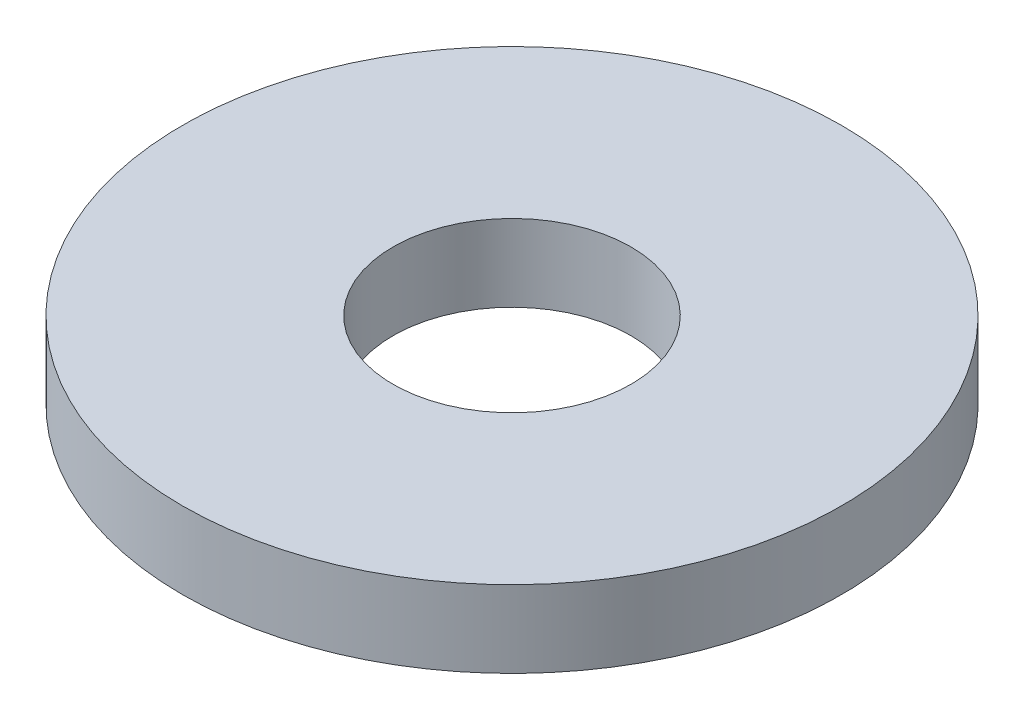
ISO-10303-21;
HEADER;
FILE_DESCRIPTION(('STEP AP214'),'2;1');
FILE_NAME('part.step','',(''),(''),'','','');
FILE_SCHEMA(('AUTOMOTIVE_DESIGN { 1 0 10303 214 1 1 1 1 }'));
ENDSEC;
DATA;
#1=APPLICATION_CONTEXT('core data for automotive mechanical design processes');
#2=APPLICATION_PROTOCOL_DEFINITION('international standard','automotive_design',2000,#1);
#3=PRODUCT_CONTEXT('',#1,'mechanical');
#4=PRODUCT('Part','Part','',(#3));
#5=PRODUCT_RELATED_PRODUCT_CATEGORY('part','',(#4));
#6=PRODUCT_DEFINITION_FORMATION('','',#4);
#7=PRODUCT_DEFINITION_CONTEXT('part definition',#1,'design');
#8=PRODUCT_DEFINITION('design','',#6,#7);
#9=PRODUCT_DEFINITION_SHAPE('','',#8);
#10=(LENGTH_UNIT() NAMED_UNIT(*) SI_UNIT(.MILLI.,.METRE.));
#11=(NAMED_UNIT(*) PLANE_ANGLE_UNIT() SI_UNIT($,.RADIAN.));
#12=(NAMED_UNIT(*) SI_UNIT($,.STERADIAN.) SOLID_ANGLE_UNIT());
#13=UNCERTAINTY_MEASURE_WITH_UNIT(LENGTH_MEASURE(1.E-05),#10,'distance_accuracy_value','');
#14=(GEOMETRIC_REPRESENTATION_CONTEXT(3) GLOBAL_UNCERTAINTY_ASSIGNED_CONTEXT((#13)) GLOBAL_UNIT_ASSIGNED_CONTEXT((#10,
#11,#12)) REPRESENTATION_CONTEXT('',''));
#15=CARTESIAN_POINT('',(0.,0.,0.));
#16=DIRECTION('',(0.,0.,1.));
#17=DIRECTION('',(1.,0.,0.));
#18=AXIS2_PLACEMENT_3D('',#15,#16,#17);
#19=CARTESIAN_POINT('',(0.,21.,0.));
#20=DIRECTION('',(0.,-1.,0.));
#21=DIRECTION('',(0.,0.,-1.));
#22=AXIS2_PLACEMENT_3D('',#19,#20,#21);
#23=CYLINDRICAL_SURFACE('',#22,90.);
#24=CARTESIAN_POINT('',(0.,21.,0.));
#25=DIRECTION('',(0.,1.,0.));
#26=DIRECTION('',(0.,0.,1.));
#27=AXIS2_PLACEMENT_3D('',#24,#25,#26);
#28=CIRCLE('',#27,90.);
#29=CARTESIAN_POINT('',(0.,21.,-90.));
#30=VERTEX_POINT('',#29);
#31=EDGE_CURVE('E10',#30,#30,#28,.T.);
#32=CARTESIAN_POINT('',(0.,0.,0.));
#33=DIRECTION('',(0.,1.,0.));
#34=DIRECTION('',(0.,0.,1.));
#35=AXIS2_PLACEMENT_3D('',#32,#33,#34);
#36=CIRCLE('',#35,90.);
#37=CARTESIAN_POINT('',(0.,0.,-90.));
#38=VERTEX_POINT('',#37);
#39=EDGE_CURVE('E37',#38,#38,#36,.T.);
#40=CARTESIAN_POINT('',(0.,21.,-90.));
#41=CARTESIAN_POINT('',(0.,20.78125,-90.));
#42=CARTESIAN_POINT('',(0.,20.5625,-90.));
#43=CARTESIAN_POINT('',(0.,20.125,-90.));
#44=CARTESIAN_POINT('',(0.,19.90625,-90.));
#45=CARTESIAN_POINT('',(0.,19.46875,-90.));
#46=CARTESIAN_POINT('',(0.,19.25,-90.));
#47=CARTESIAN_POINT('',(0.,18.8125,-90.));
#48=CARTESIAN_POINT('',(0.,18.59375,-90.));
#49=CARTESIAN_POINT('',(0.,18.15625,-90.));
#50=CARTESIAN_POINT('',(0.,17.9375,-90.));
#51=CARTESIAN_POINT('',(0.,17.5,-90.));
#52=CARTESIAN_POINT('',(0.,17.28125,-90.));
#53=CARTESIAN_POINT('',(0.,16.84375,-90.));
#54=CARTESIAN_POINT('',(0.,16.625,-90.));
#55=CARTESIAN_POINT('',(0.,16.1875,-90.));
#56=CARTESIAN_POINT('',(0.,15.96875,-90.));
#57=CARTESIAN_POINT('',(0.,15.53125,-90.));
#58=CARTESIAN_POINT('',(0.,15.3125,-90.));
#59=CARTESIAN_POINT('',(0.,14.875,-90.));
#60=CARTESIAN_POINT('',(0.,14.65625,-90.));
#61=CARTESIAN_POINT('',(0.,14.21875,-90.));
#62=CARTESIAN_POINT('',(0.,14.,-90.));
#63=CARTESIAN_POINT('',(0.,13.5625,-90.));
#64=CARTESIAN_POINT('',(0.,13.34375,-90.));
#65=CARTESIAN_POINT('',(0.,12.90625,-90.));
#66=CARTESIAN_POINT('',(0.,12.6875,-90.));
#67=CARTESIAN_POINT('',(0.,12.25,-90.));
#68=CARTESIAN_POINT('',(0.,12.03125,-90.));
#69=CARTESIAN_POINT('',(0.,11.59375,-90.));
#70=CARTESIAN_POINT('',(0.,11.375,-90.));
#71=CARTESIAN_POINT('',(0.,10.9375,-90.));
#72=CARTESIAN_POINT('',(0.,10.71875,-90.));
#73=CARTESIAN_POINT('',(0.,10.28125,-90.));
#74=CARTESIAN_POINT('',(0.,10.0625,-90.));
#75=CARTESIAN_POINT('',(0.,9.625,-90.));
#76=CARTESIAN_POINT('',(0.,9.40625,-90.));
#77=CARTESIAN_POINT('',(0.,8.96875,-90.));
#78=CARTESIAN_POINT('',(0.,8.75,-90.));
#79=CARTESIAN_POINT('',(0.,8.3125,-90.));
#80=CARTESIAN_POINT('',(0.,8.09375,-90.));
#81=CARTESIAN_POINT('',(0.,7.65625,-90.));
#82=CARTESIAN_POINT('',(0.,7.4375,-90.));
#83=CARTESIAN_POINT('',(0.,7.,-90.));
#84=CARTESIAN_POINT('',(0.,6.78125,-90.));
#85=CARTESIAN_POINT('',(0.,6.34375,-90.));
#86=CARTESIAN_POINT('',(0.,6.125,-90.));
#87=CARTESIAN_POINT('',(0.,5.6875,-90.));
#88=CARTESIAN_POINT('',(0.,5.46875,-90.));
#89=CARTESIAN_POINT('',(0.,5.03125,-90.));
#90=CARTESIAN_POINT('',(0.,4.8125,-90.));
#91=CARTESIAN_POINT('',(0.,4.375,-90.));
#92=CARTESIAN_POINT('',(0.,4.15625,-90.));
#93=CARTESIAN_POINT('',(0.,3.71875,-90.));
#94=CARTESIAN_POINT('',(0.,3.5,-90.));
#95=CARTESIAN_POINT('',(0.,3.0625,-90.));
#96=CARTESIAN_POINT('',(0.,2.84375,-90.));
#97=CARTESIAN_POINT('',(0.,2.40625,-90.));
#98=CARTESIAN_POINT('',(0.,2.1875,-90.));
#99=CARTESIAN_POINT('',(0.,1.75,-90.));
#100=CARTESIAN_POINT('',(0.,1.53125,-90.));
#101=CARTESIAN_POINT('',(0.,1.09375,-90.));
#102=CARTESIAN_POINT('',(0.,0.875000000000001,-90.));
#103=CARTESIAN_POINT('',(0.,0.4375,-90.));
#104=CARTESIAN_POINT('',(0.,0.21875,-90.));
#105=CARTESIAN_POINT('',(0.,0.,-90.));
#106=B_SPLINE_CURVE_WITH_KNOTS('',3,(#40,#41,#42,#43,#44,#45,#46,#47,#48,#49,#50,#51,#52,#53,
#54,#55,#56,#57,#58,#59,#60,#61,#62,#63,#64,#65,#66,#67,#68,#69,#70,#71,#72,#73,#74,#75,#76,#77,
#78,#79,#80,#81,#82,#83,#84,#85,#86,#87,#88,#89,#90,#91,#92,#93,#94,#95,#96,#97,#98,#99,#100,
#101,#102,#103,#104,#105),.UNSPECIFIED.,.F.,.F.,(4,2,2,2,2,2,2,2,2,2,2,2,2,2,2,2,2,2,2,2,2,2,2,
2,2,2,2,2,2,2,2,2,4),(0.,0.656250000000001,1.3125,1.96875,2.625,3.28125,3.9375,4.59375,5.25,
5.90625,6.5625,7.21875,7.875,8.53125,9.1875,9.84375,10.5,11.15625,11.8125,12.46875,13.125,
13.78125,14.4375,15.09375,15.75,16.40625,17.0625,17.71875,18.375,19.03125,19.6875,20.34375,21.),.UNSPECIFIED.);
#107=EDGE_CURVE('BSEAM40',#30,#38,#106,.T.);
#108=ORIENTED_EDGE('',*,*,#31,.F.);
#109=ORIENTED_EDGE('',*,*,#39,.T.);
#110=ORIENTED_EDGE('',*,*,#107,.T.);
#111=ORIENTED_EDGE('',*,*,#107,.F.);
#112=EDGE_LOOP('',(#108,#110,#109,#111));
#113=FACE_BOUND('',#112,.T.);
#114=ADVANCED_FACE('F40',(#113),#23,.T.);
#115=CARTESIAN_POINT('',(0.,21.,0.));
#116=DIRECTION('',(0.,1.,0.));
#117=DIRECTION('',(0.,0.,1.));
#118=AXIS2_PLACEMENT_3D('',#115,#116,#117);
#119=PLANE('',#118);
#120=CARTESIAN_POINT('',(0.,21.,0.));
#121=DIRECTION('',(0.,1.,0.));
#122=DIRECTION('',(0.,0.,1.));
#123=AXIS2_PLACEMENT_3D('',#120,#121,#122);
#124=CIRCLE('',#123,32.5);
#125=CARTESIAN_POINT('',(0.,21.,-32.5));
#126=VERTEX_POINT('',#125);
#127=EDGE_CURVE('E50',#126,#126,#124,.T.);
#128=ORIENTED_EDGE('',*,*,#127,.F.);
#129=EDGE_LOOP('',(#128));
#130=FACE_BOUND('',#129,.T.);
#131=ORIENTED_EDGE('',*,*,#31,.T.);
#132=EDGE_LOOP('',(#131));
#133=FACE_BOUND('',#132,.T.);
#134=ADVANCED_FACE('F59',(#130,#133),#119,.T.);
#135=CARTESIAN_POINT('',(0.,0.,0.));
#136=DIRECTION('',(0.,1.,0.));
#137=DIRECTION('',(0.,0.,1.));
#138=AXIS2_PLACEMENT_3D('',#135,#136,#137);
#139=PLANE('',#138);
#140=CARTESIAN_POINT('',(0.,0.,0.));
#141=DIRECTION('',(0.,1.,0.));
#142=DIRECTION('',(0.,0.,1.));
#143=AXIS2_PLACEMENT_3D('',#140,#141,#142);
#144=CIRCLE('',#143,32.5);
#145=CARTESIAN_POINT('',(0.,0.,-32.5));
#146=VERTEX_POINT('',#145);
#147=EDGE_CURVE('E47',#146,#146,#144,.T.);
#148=ORIENTED_EDGE('',*,*,#147,.T.);
#149=EDGE_LOOP('',(#148));
#150=FACE_BOUND('',#149,.T.);
#151=ORIENTED_EDGE('',*,*,#39,.F.);
#152=EDGE_LOOP('',(#151));
#153=FACE_BOUND('',#152,.T.);
#154=ADVANCED_FACE('F58',(#150,#153),#139,.F.);
#155=CARTESIAN_POINT('',(0.,21.,0.));
#156=DIRECTION('',(0.,-1.,0.));
#157=DIRECTION('',(0.,0.,-1.));
#158=AXIS2_PLACEMENT_3D('',#155,#156,#157);
#159=CYLINDRICAL_SURFACE('',#158,32.5);
#160=CARTESIAN_POINT('',(0.,21.,-32.5));
#161=CARTESIAN_POINT('',(0.,20.78125,-32.5));
#162=CARTESIAN_POINT('',(0.,20.5625,-32.5));
#163=CARTESIAN_POINT('',(0.,20.125,-32.5));
#164=CARTESIAN_POINT('',(0.,19.90625,-32.5));
#165=CARTESIAN_POINT('',(0.,19.46875,-32.5));
#166=CARTESIAN_POINT('',(0.,19.25,-32.5));
#167=CARTESIAN_POINT('',(0.,18.8125,-32.5));
#168=CARTESIAN_POINT('',(0.,18.59375,-32.5));
#169=CARTESIAN_POINT('',(0.,18.15625,-32.5));
#170=CARTESIAN_POINT('',(0.,17.9375,-32.5));
#171=CARTESIAN_POINT('',(0.,17.5,-32.5));
#172=CARTESIAN_POINT('',(0.,17.28125,-32.5));
#173=CARTESIAN_POINT('',(0.,16.84375,-32.5));
#174=CARTESIAN_POINT('',(0.,16.625,-32.5));
#175=CARTESIAN_POINT('',(0.,16.1875,-32.5));
#176=CARTESIAN_POINT('',(0.,15.96875,-32.5));
#177=CARTESIAN_POINT('',(0.,15.53125,-32.5));
#178=CARTESIAN_POINT('',(0.,15.3125,-32.5));
#179=CARTESIAN_POINT('',(0.,14.875,-32.5));
#180=CARTESIAN_POINT('',(0.,14.65625,-32.5));
#181=CARTESIAN_POINT('',(0.,14.21875,-32.5));
#182=CARTESIAN_POINT('',(0.,14.,-32.5));
#183=CARTESIAN_POINT('',(0.,13.5625,-32.5));
#184=CARTESIAN_POINT('',(0.,13.34375,-32.5));
#185=CARTESIAN_POINT('',(0.,12.90625,-32.5));
#186=CARTESIAN_POINT('',(0.,12.6875,-32.5));
#187=CARTESIAN_POINT('',(0.,12.25,-32.5));
#188=CARTESIAN_POINT('',(0.,12.03125,-32.5));
#189=CARTESIAN_POINT('',(0.,11.59375,-32.5));
#190=CARTESIAN_POINT('',(0.,11.375,-32.5));
#191=CARTESIAN_POINT('',(0.,10.9375,-32.5));
#192=CARTESIAN_POINT('',(0.,10.71875,-32.5));
#193=CARTESIAN_POINT('',(0.,10.28125,-32.5));
#194=CARTESIAN_POINT('',(0.,10.0625,-32.5));
#195=CARTESIAN_POINT('',(0.,9.625,-32.5));
#196=CARTESIAN_POINT('',(0.,9.40625,-32.5));
#197=CARTESIAN_POINT('',(0.,8.96875,-32.5));
#198=CARTESIAN_POINT('',(0.,8.75,-32.5));
#199=CARTESIAN_POINT('',(0.,8.3125,-32.5));
#200=CARTESIAN_POINT('',(0.,8.09375,-32.5));
#201=CARTESIAN_POINT('',(0.,7.65625,-32.5));
#202=CARTESIAN_POINT('',(0.,7.4375,-32.5));
#203=CARTESIAN_POINT('',(0.,7.,-32.5));
#204=CARTESIAN_POINT('',(0.,6.78125,-32.5));
#205=CARTESIAN_POINT('',(0.,6.34375,-32.5));
#206=CARTESIAN_POINT('',(0.,6.125,-32.5));
#207=CARTESIAN_POINT('',(0.,5.6875,-32.5));
#208=CARTESIAN_POINT('',(0.,5.46875,-32.5));
#209=CARTESIAN_POINT('',(0.,5.03125,-32.5));
#210=CARTESIAN_POINT('',(0.,4.8125,-32.5));
#211=CARTESIAN_POINT('',(0.,4.375,-32.5));
#212=CARTESIAN_POINT('',(0.,4.15625,-32.5));
#213=CARTESIAN_POINT('',(0.,3.71875,-32.5));
#214=CARTESIAN_POINT('',(0.,3.5,-32.5));
#215=CARTESIAN_POINT('',(0.,3.0625,-32.5));
#216=CARTESIAN_POINT('',(0.,2.84375,-32.5));
#217=CARTESIAN_POINT('',(0.,2.40625,-32.5));
#218=CARTESIAN_POINT('',(0.,2.1875,-32.5));
#219=CARTESIAN_POINT('',(0.,1.75,-32.5));
#220=CARTESIAN_POINT('',(0.,1.53125,-32.5));
#221=CARTESIAN_POINT('',(0.,1.09375,-32.5));
#222=CARTESIAN_POINT('',(0.,0.875000000000001,-32.5));
#223=CARTESIAN_POINT('',(0.,0.4375,-32.5));
#224=CARTESIAN_POINT('',(0.,0.21875,-32.5));
#225=CARTESIAN_POINT('',(0.,0.,-32.5));
#226=B_SPLINE_CURVE_WITH_KNOTS('',3,(#160,#161,#162,#163,#164,#165,#166,#167,#168,#169,#170,
#171,#172,#173,#174,#175,#176,#177,#178,#179,#180,#181,#182,#183,#184,#185,#186,#187,#188,#189,
#190,#191,#192,#193,#194,#195,#196,#197,#198,#199,#200,#201,#202,#203,#204,#205,#206,#207,#208,
#209,#210,#211,#212,#213,#214,#215,#216,#217,#218,#219,#220,#221,#222,#223,#224,#225),
.UNSPECIFIED.,.F.,.F.,(4,2,2,2,2,2,2,2,2,2,2,2,2,2,2,2,2,2,2,2,2,2,2,2,2,2,2,2,2,2,2,2,4),(0.,
0.656249999999997,1.3125,1.96875,2.625,3.28125,3.9375,4.59375,5.25,5.90625,6.5625,7.21875,7.875,
8.53125,9.1875,9.84375,10.5,11.15625,11.8125,12.46875,13.125,13.78125,14.4375,15.09375,15.75,
16.40625,17.0625,17.71875,18.375,19.03125,19.6875,20.34375,21.),.UNSPECIFIED.);
#227=EDGE_CURVE('BSEAM54',#126,#146,#226,.T.);
#228=ORIENTED_EDGE('',*,*,#127,.T.);
#229=ORIENTED_EDGE('',*,*,#147,.F.);
#230=ORIENTED_EDGE('',*,*,#227,.T.);
#231=ORIENTED_EDGE('',*,*,#227,.F.);
#232=EDGE_LOOP('',(#228,#230,#229,#231));
#233=FACE_BOUND('',#232,.T.);
#234=ADVANCED_FACE('F54',(#233),#159,.F.);
#235=CLOSED_SHELL('',(#114,#134,#154,#234));
#236=MANIFOLD_SOLID_BREP('B2',#235);
#237=ADVANCED_BREP_SHAPE_REPRESENTATION('',(#18,#236),#14);
#238=SHAPE_DEFINITION_REPRESENTATION(#9,#237);
ENDSEC;
END-ISO-10303-21;
